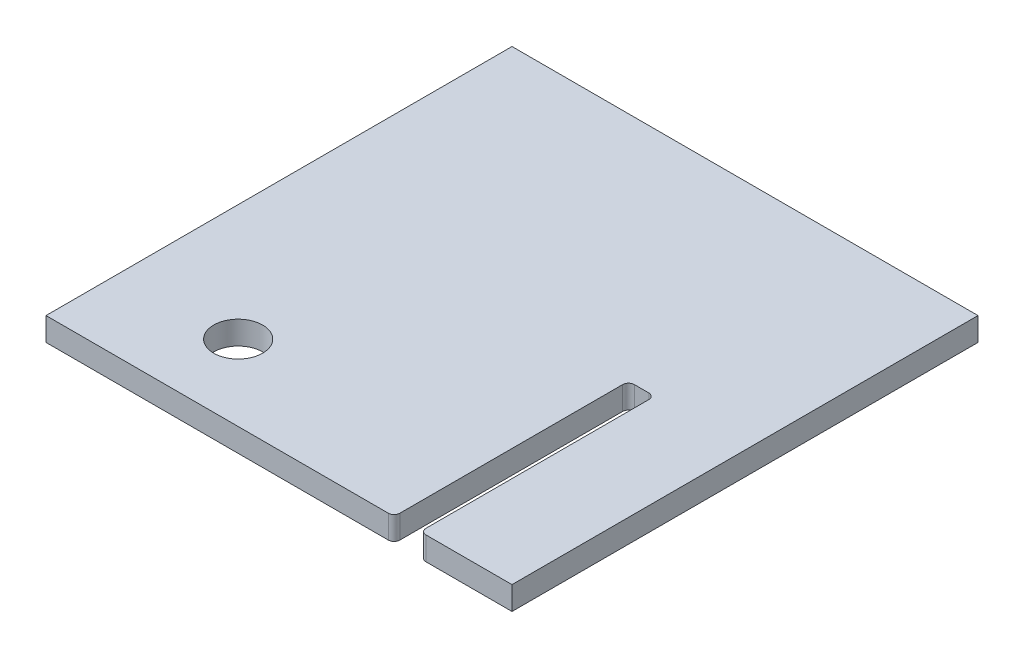
ISO-10303-21;
HEADER;
FILE_DESCRIPTION(('STEP AP214'),'2;1');
FILE_NAME('part.step','',(''),(''),'','','');
FILE_SCHEMA(('AUTOMOTIVE_DESIGN { 1 0 10303 214 1 1 1 1 }'));
ENDSEC;
DATA;
#1=APPLICATION_CONTEXT('core data for automotive mechanical design processes');
#2=APPLICATION_PROTOCOL_DEFINITION('international standard','automotive_design',2000,#1);
#3=PRODUCT_CONTEXT('',#1,'mechanical');
#4=PRODUCT('Part','Part','',(#3));
#5=PRODUCT_RELATED_PRODUCT_CATEGORY('part','',(#4));
#6=PRODUCT_DEFINITION_FORMATION('','',#4);
#7=PRODUCT_DEFINITION_CONTEXT('part definition',#1,'design');
#8=PRODUCT_DEFINITION('design','',#6,#7);
#9=PRODUCT_DEFINITION_SHAPE('','',#8);
#10=(LENGTH_UNIT() NAMED_UNIT(*) SI_UNIT(.MILLI.,.METRE.));
#11=(NAMED_UNIT(*) PLANE_ANGLE_UNIT() SI_UNIT($,.RADIAN.));
#12=(NAMED_UNIT(*) SI_UNIT($,.STERADIAN.) SOLID_ANGLE_UNIT());
#13=UNCERTAINTY_MEASURE_WITH_UNIT(LENGTH_MEASURE(1.E-05),#10,'distance_accuracy_value','');
#14=(GEOMETRIC_REPRESENTATION_CONTEXT(3) GLOBAL_UNCERTAINTY_ASSIGNED_CONTEXT((#13)) GLOBAL_UNIT_ASSIGNED_CONTEXT((#10,
#11,#12)) REPRESENTATION_CONTEXT('',''));
#15=CARTESIAN_POINT('',(0.,0.,0.));
#16=DIRECTION('',(0.,0.,1.));
#17=DIRECTION('',(1.,0.,0.));
#18=AXIS2_PLACEMENT_3D('',#15,#16,#17);
#19=CARTESIAN_POINT('',(-127.,6.35,0.));
#20=DIRECTION('',(0.,0.,-1.));
#21=DIRECTION('',(-1.,0.,0.));
#22=AXIS2_PLACEMENT_3D('',#19,#20,#21);
#23=PLANE('',#22);
#24=DIRECTION('',(1.,0.,0.));
#25=VECTOR('',#24,1.);
#26=CARTESIAN_POINT('',(-127.,6.35,0.));
#27=LINE('',#26,#25);
#28=CARTESIAN_POINT('',(80.1370000000002,6.35,0.));
#29=VERTEX_POINT('',#28);
#30=CARTESIAN_POINT('',(127.,6.35,0.));
#31=VERTEX_POINT('',#30);
#32=EDGE_CURVE('E186',#29,#31,#27,.T.);
#33=ORIENTED_EDGE('',*,*,#32,.F.);
#34=DIRECTION('',(0.,1.,0.));
#35=VECTOR('',#34,1.);
#36=CARTESIAN_POINT('',(80.1370000000002,6.35,0.));
#37=LINE('',#36,#35);
#38=CARTESIAN_POINT('',(80.1370000000002,-6.35,0.));
#39=VERTEX_POINT('',#38);
#40=EDGE_CURVE('E220',#29,#39,#37,.F.);
#41=ORIENTED_EDGE('',*,*,#40,.T.);
#42=DIRECTION('',(1.,0.,0.));
#43=VECTOR('',#42,1.);
#44=CARTESIAN_POINT('',(-127.,-6.35,0.));
#45=LINE('',#44,#43);
#46=CARTESIAN_POINT('',(127.,-6.35,0.));
#47=VERTEX_POINT('',#46);
#48=EDGE_CURVE('E159',#39,#47,#45,.T.);
#49=ORIENTED_EDGE('',*,*,#48,.T.);
#50=DIRECTION('',(0.,-1.,0.));
#51=VECTOR('',#50,1.);
#52=CARTESIAN_POINT('',(127.,6.35,0.));
#53=LINE('',#52,#51);
#54=EDGE_CURVE('E149',#31,#47,#53,.T.);
#55=ORIENTED_EDGE('',*,*,#54,.F.);
#56=EDGE_LOOP('',(#33,#41,#49,#55));
#57=FACE_BOUND('',#56,.T.);
#58=ADVANCED_FACE('F44',(#57),#23,.F.);
#59=CARTESIAN_POINT('',(-127.,6.35,0.));
#60=DIRECTION('',(1.,0.,0.));
#61=DIRECTION('',(0.,0.,-1.));
#62=AXIS2_PLACEMENT_3D('',#59,#60,#61);
#63=PLANE('',#62);
#64=DIRECTION('',(0.,0.,1.));
#65=VECTOR('',#64,1.);
#66=CARTESIAN_POINT('',(-127.,-6.35,0.));
#67=LINE('',#66,#65);
#68=CARTESIAN_POINT('',(-127.,-6.35,-254.));
#69=VERTEX_POINT('',#68);
#70=CARTESIAN_POINT('',(-127.,-6.35,0.));
#71=VERTEX_POINT('',#70);
#72=EDGE_CURVE('E155',#69,#71,#67,.T.);
#73=ORIENTED_EDGE('',*,*,#72,.T.);
#74=DIRECTION('',(0.,-1.,0.));
#75=VECTOR('',#74,1.);
#76=CARTESIAN_POINT('',(-127.,6.35,0.));
#77=LINE('',#76,#75);
#78=CARTESIAN_POINT('',(-127.,6.35,0.));
#79=VERTEX_POINT('',#78);
#80=EDGE_CURVE('E291',#79,#71,#77,.T.);
#81=ORIENTED_EDGE('',*,*,#80,.F.);
#82=DIRECTION('',(0.,0.,1.));
#83=VECTOR('',#82,1.);
#84=CARTESIAN_POINT('',(-127.,6.35,0.));
#85=LINE('',#84,#83);
#86=CARTESIAN_POINT('',(-127.,6.35,-254.));
#87=VERTEX_POINT('',#86);
#88=EDGE_CURVE('E157',#87,#79,#85,.T.);
#89=ORIENTED_EDGE('',*,*,#88,.F.);
#90=DIRECTION('',(0.,-1.,0.));
#91=VECTOR('',#90,1.);
#92=CARTESIAN_POINT('',(-127.,6.35,-254.));
#93=LINE('',#92,#91);
#94=EDGE_CURVE('E142',#87,#69,#93,.T.);
#95=ORIENTED_EDGE('',*,*,#94,.T.);
#96=EDGE_LOOP('',(#73,#81,#89,#95));
#97=FACE_BOUND('',#96,.T.);
#98=ADVANCED_FACE('F153',(#97),#63,.F.);
#99=CARTESIAN_POINT('',(59.5630000000002,-6.35,0.));
#100=VERTEX_POINT('',#99);
#101=EDGE_CURVE('E164',#71,#100,#45,.T.);
#102=ORIENTED_EDGE('',*,*,#101,.T.);
#103=DIRECTION('',(0.,1.,0.));
#104=VECTOR('',#103,1.);
#105=CARTESIAN_POINT('',(59.5630000000002,6.35,0.));
#106=LINE('',#105,#104);
#107=CARTESIAN_POINT('',(59.5630000000002,6.35,0.));
#108=VERTEX_POINT('',#107);
#109=EDGE_CURVE('E228',#100,#108,#106,.T.);
#110=ORIENTED_EDGE('',*,*,#109,.T.);
#111=EDGE_CURVE('E182',#79,#108,#27,.T.);
#112=ORIENTED_EDGE('',*,*,#111,.F.);
#113=ORIENTED_EDGE('',*,*,#80,.T.);
#114=EDGE_LOOP('',(#102,#110,#112,#113));
#115=FACE_BOUND('',#114,.T.);
#116=ADVANCED_FACE('F290',(#115),#23,.F.);
#117=CARTESIAN_POINT('',(127.,6.35,0.));
#118=DIRECTION('',(-1.,0.,0.));
#119=DIRECTION('',(0.,0.,1.));
#120=AXIS2_PLACEMENT_3D('',#117,#118,#119);
#121=PLANE('',#120);
#122=DIRECTION('',(0.,0.,-1.));
#123=VECTOR('',#122,1.);
#124=CARTESIAN_POINT('',(127.,-6.35,0.));
#125=LINE('',#124,#123);
#126=CARTESIAN_POINT('',(127.,-6.35,-254.));
#127=VERTEX_POINT('',#126);
#128=EDGE_CURVE('E295',#47,#127,#125,.T.);
#129=ORIENTED_EDGE('',*,*,#128,.T.);
#130=DIRECTION('',(0.,-1.,0.));
#131=VECTOR('',#130,1.);
#132=CARTESIAN_POINT('',(127.,6.35,-254.));
#133=LINE('',#132,#131);
#134=CARTESIAN_POINT('',(127.,6.35,-254.));
#135=VERTEX_POINT('',#134);
#136=EDGE_CURVE('E145',#135,#127,#133,.T.);
#137=ORIENTED_EDGE('',*,*,#136,.F.);
#138=DIRECTION('',(0.,0.,-1.));
#139=VECTOR('',#138,1.);
#140=CARTESIAN_POINT('',(127.,6.35,0.));
#141=LINE('',#140,#139);
#142=EDGE_CURVE('E179',#31,#135,#141,.T.);
#143=ORIENTED_EDGE('',*,*,#142,.F.);
#144=ORIENTED_EDGE('',*,*,#54,.T.);
#145=EDGE_LOOP('',(#129,#137,#143,#144));
#146=FACE_BOUND('',#145,.T.);
#147=ADVANCED_FACE('F304',(#146),#121,.F.);
#148=CARTESIAN_POINT('',(-127.,6.35,-254.));
#149=DIRECTION('',(0.,0.,1.));
#150=DIRECTION('',(1.,0.,0.));
#151=AXIS2_PLACEMENT_3D('',#148,#149,#150);
#152=PLANE('',#151);
#153=DIRECTION('',(-1.,0.,0.));
#154=VECTOR('',#153,1.);
#155=CARTESIAN_POINT('',(-127.,-6.35,-254.));
#156=LINE('',#155,#154);
#157=EDGE_CURVE('E138',#127,#69,#156,.T.);
#158=ORIENTED_EDGE('',*,*,#157,.T.);
#159=ORIENTED_EDGE('',*,*,#94,.F.);
#160=DIRECTION('',(-1.,0.,0.));
#161=VECTOR('',#160,1.);
#162=CARTESIAN_POINT('',(-127.,6.35,-254.));
#163=LINE('',#162,#161);
#164=EDGE_CURVE('E175',#135,#87,#163,.T.);
#165=ORIENTED_EDGE('',*,*,#164,.F.);
#166=ORIENTED_EDGE('',*,*,#136,.T.);
#167=EDGE_LOOP('',(#158,#159,#165,#166));
#168=FACE_BOUND('',#167,.T.);
#169=ADVANCED_FACE('F140',(#168),#152,.F.);
#170=CARTESIAN_POINT('',(0.,6.35,0.));
#171=DIRECTION('',(0.,-1.,0.));
#172=DIRECTION('',(0.,0.,-1.));
#173=AXIS2_PLACEMENT_3D('',#170,#171,#172);
#174=PLANE('',#173);
#175=CARTESIAN_POINT('',(-63.4999999999998,6.35000000000002,-41.2500000000038));
#176=DIRECTION('',(0.,-1.,0.));
#177=DIRECTION('',(0.,0.,-1.));
#178=AXIS2_PLACEMENT_3D('',#175,#176,#177);
#179=CIRCLE('',#178,13.335);
#180=CARTESIAN_POINT('',(-63.4999999999998,6.35000000000002,-54.5850000000038));
#181=VERTEX_POINT('',#180);
#182=EDGE_CURVE('E48',#181,#181,#179,.F.);
#183=ORIENTED_EDGE('',*,*,#182,.F.);
#184=EDGE_LOOP('',(#183));
#185=FACE_BOUND('',#184,.T.);
#186=DIRECTION('',(0.,0.,-1.));
#187=VECTOR('',#186,1.);
#188=CARTESIAN_POINT('',(76.9620000000002,6.35,0.));
#189=LINE('',#188,#187);
#190=CARTESIAN_POINT('',(76.9620000000002,6.35,-3.17500000000004));
#191=VERTEX_POINT('',#190);
#192=CARTESIAN_POINT('',(76.9620000000002,6.35,-124.587));
#193=VERTEX_POINT('',#192);
#194=EDGE_CURVE('E200',#191,#193,#189,.T.);
#195=ORIENTED_EDGE('',*,*,#194,.F.);
#196=CARTESIAN_POINT('',(80.1370000000002,6.35,-3.17500000000004));
#197=DIRECTION('',(0.,-1.,0.));
#198=DIRECTION('',(0.,0.,-1.));
#199=AXIS2_PLACEMENT_3D('',#196,#197,#198);
#200=CIRCLE('',#199,3.175);
#201=EDGE_CURVE('E217',#191,#29,#200,.F.);
#202=ORIENTED_EDGE('',*,*,#201,.T.);
#203=ORIENTED_EDGE('',*,*,#32,.T.);
#204=ORIENTED_EDGE('',*,*,#142,.T.);
#205=ORIENTED_EDGE('',*,*,#164,.T.);
#206=ORIENTED_EDGE('',*,*,#88,.T.);
#207=ORIENTED_EDGE('',*,*,#111,.T.);
#208=CARTESIAN_POINT('',(59.5630000000002,6.35,-3.17500000000003));
#209=DIRECTION('',(0.,-1.,0.));
#210=DIRECTION('',(0.,0.,-1.));
#211=AXIS2_PLACEMENT_3D('',#208,#209,#210);
#212=CIRCLE('',#211,3.175);
#213=CARTESIAN_POINT('',(62.7380000000002,6.35,-3.17500000000003));
#214=VERTEX_POINT('',#213);
#215=EDGE_CURVE('E214',#108,#214,#212,.F.);
#216=ORIENTED_EDGE('',*,*,#215,.T.);
#217=DIRECTION('',(0.,0.,1.));
#218=VECTOR('',#217,1.);
#219=CARTESIAN_POINT('',(62.7380000000002,6.35,0.));
#220=LINE('',#219,#218);
#221=CARTESIAN_POINT('',(62.7380000000002,6.35,-124.587));
#222=VERTEX_POINT('',#221);
#223=EDGE_CURVE('E193',#222,#214,#220,.T.);
#224=ORIENTED_EDGE('',*,*,#223,.F.);
#225=CARTESIAN_POINT('',(65.9130000000002,6.35,-124.587));
#226=DIRECTION('',(0.,-1.,0.));
#227=DIRECTION('',(0.,0.,-1.));
#228=AXIS2_PLACEMENT_3D('',#225,#226,#227);
#229=CIRCLE('',#228,3.175);
#230=CARTESIAN_POINT('',(65.9130000000002,6.35,-127.762));
#231=VERTEX_POINT('',#230);
#232=EDGE_CURVE('E245',#222,#231,#229,.T.);
#233=ORIENTED_EDGE('',*,*,#232,.T.);
#234=DIRECTION('',(-1.,0.,0.));
#235=VECTOR('',#234,1.);
#236=CARTESIAN_POINT('',(76.2000000000002,6.35,-127.762));
#237=LINE('',#236,#235);
#238=CARTESIAN_POINT('',(73.7870000000002,6.35,-127.762));
#239=VERTEX_POINT('',#238);
#240=EDGE_CURVE('E196',#239,#231,#237,.T.);
#241=ORIENTED_EDGE('',*,*,#240,.F.);
#242=CARTESIAN_POINT('',(73.7870000000002,6.35,-124.587));
#243=DIRECTION('',(0.,-1.,0.));
#244=DIRECTION('',(0.,0.,-1.));
#245=AXIS2_PLACEMENT_3D('',#242,#243,#244);
#246=CIRCLE('',#245,3.175);
#247=EDGE_CURVE('E54',#239,#193,#246,.T.);
#248=ORIENTED_EDGE('',*,*,#247,.T.);
#249=EDGE_LOOP('',(#195,#202,#203,#204,#205,#206,#207,#216,#224,#233,#241,#248));
#250=FACE_BOUND('',#249,.T.);
#251=ADVANCED_FACE('F260',(#185,#250),#174,.F.);
#252=CARTESIAN_POINT('',(0.,-6.35,0.));
#253=DIRECTION('',(0.,-1.,0.));
#254=DIRECTION('',(0.,0.,-1.));
#255=AXIS2_PLACEMENT_3D('',#252,#253,#254);
#256=PLANE('',#255);
#257=ORIENTED_EDGE('',*,*,#48,.F.);
#258=CARTESIAN_POINT('',(80.1370000000002,-6.35,-3.17500000000004));
#259=DIRECTION('',(0.,-1.,0.));
#260=DIRECTION('',(0.,0.,-1.));
#261=AXIS2_PLACEMENT_3D('',#258,#259,#260);
#262=CIRCLE('',#261,3.175);
#263=CARTESIAN_POINT('',(76.9620000000002,-6.35,-3.17500000000004));
#264=VERTEX_POINT('',#263);
#265=EDGE_CURVE('E225',#39,#264,#262,.T.);
#266=ORIENTED_EDGE('',*,*,#265,.T.);
#267=DIRECTION('',(0.,0.,-1.));
#268=VECTOR('',#267,1.);
#269=CARTESIAN_POINT('',(76.9620000000002,-6.35,0.));
#270=LINE('',#269,#268);
#271=CARTESIAN_POINT('',(76.9620000000002,-6.35,-124.587));
#272=VERTEX_POINT('',#271);
#273=EDGE_CURVE('E191',#264,#272,#270,.T.);
#274=ORIENTED_EDGE('',*,*,#273,.T.);
#275=CARTESIAN_POINT('',(73.7870000000002,-6.35,-124.587));
#276=DIRECTION('',(0.,-1.,0.));
#277=DIRECTION('',(0.,0.,-1.));
#278=AXIS2_PLACEMENT_3D('',#275,#276,#277);
#279=CIRCLE('',#278,3.175);
#280=CARTESIAN_POINT('',(73.7870000000002,-6.35,-127.762));
#281=VERTEX_POINT('',#280);
#282=EDGE_CURVE('E12',#272,#281,#279,.F.);
#283=ORIENTED_EDGE('',*,*,#282,.T.);
#284=DIRECTION('',(-1.,0.,0.));
#285=VECTOR('',#284,1.);
#286=CARTESIAN_POINT('',(76.2000000000002,-6.35,-127.762));
#287=LINE('',#286,#285);
#288=CARTESIAN_POINT('',(65.9130000000002,-6.35,-127.762));
#289=VERTEX_POINT('',#288);
#290=EDGE_CURVE('E170',#281,#289,#287,.T.);
#291=ORIENTED_EDGE('',*,*,#290,.T.);
#292=CARTESIAN_POINT('',(65.9130000000002,-6.35,-124.587));
#293=DIRECTION('',(0.,-1.,0.));
#294=DIRECTION('',(0.,0.,-1.));
#295=AXIS2_PLACEMENT_3D('',#292,#293,#294);
#296=CIRCLE('',#295,3.175);
#297=CARTESIAN_POINT('',(62.7380000000002,-6.35,-124.587));
#298=VERTEX_POINT('',#297);
#299=EDGE_CURVE('E248',#289,#298,#296,.F.);
#300=ORIENTED_EDGE('',*,*,#299,.T.);
#301=DIRECTION('',(0.,0.,1.));
#302=VECTOR('',#301,1.);
#303=CARTESIAN_POINT('',(62.7380000000002,-6.35,0.));
#304=LINE('',#303,#302);
#305=CARTESIAN_POINT('',(62.7380000000002,-6.35,-3.17500000000003));
#306=VERTEX_POINT('',#305);
#307=EDGE_CURVE('E167',#298,#306,#304,.T.);
#308=ORIENTED_EDGE('',*,*,#307,.T.);
#309=CARTESIAN_POINT('',(59.5630000000002,-6.35,-3.17500000000003));
#310=DIRECTION('',(0.,-1.,0.));
#311=DIRECTION('',(0.,0.,-1.));
#312=AXIS2_PLACEMENT_3D('',#309,#310,#311);
#313=CIRCLE('',#312,3.175);
#314=EDGE_CURVE('E62',#306,#100,#313,.T.);
#315=ORIENTED_EDGE('',*,*,#314,.T.);
#316=ORIENTED_EDGE('',*,*,#101,.F.);
#317=ORIENTED_EDGE('',*,*,#72,.F.);
#318=ORIENTED_EDGE('',*,*,#157,.F.);
#319=ORIENTED_EDGE('',*,*,#128,.F.);
#320=EDGE_LOOP('',(#257,#266,#274,#283,#291,#300,#308,#315,#316,#317,#318,#319));
#321=FACE_BOUND('',#320,.T.);
#322=CARTESIAN_POINT('',(-63.4999999999998,-6.35000000000002,-41.2500000000038));
#323=DIRECTION('',(0.,-1.,0.));
#324=DIRECTION('',(0.,0.,-1.));
#325=AXIS2_PLACEMENT_3D('',#322,#323,#324);
#326=CIRCLE('',#325,13.335);
#327=CARTESIAN_POINT('',(-63.4999999999998,-6.35000000000002,-54.5850000000038));
#328=VERTEX_POINT('',#327);
#329=EDGE_CURVE('E178',#328,#328,#326,.F.);
#330=ORIENTED_EDGE('',*,*,#329,.T.);
#331=EDGE_LOOP('',(#330));
#332=FACE_BOUND('',#331,.T.);
#333=ADVANCED_FACE('F162',(#321,#332),#256,.T.);
#334=CARTESIAN_POINT('',(-63.4999999999998,280.149999999998,-41.2500000000038));
#335=DIRECTION('',(0.,-1.,0.));
#336=DIRECTION('',(0.,0.,-1.));
#337=AXIS2_PLACEMENT_3D('',#334,#335,#336);
#338=CYLINDRICAL_SURFACE('',#337,13.335);
#339=ORIENTED_EDGE('',*,*,#329,.F.);
#340=EDGE_LOOP('',(#339));
#341=FACE_BOUND('',#340,.T.);
#342=ORIENTED_EDGE('',*,*,#182,.T.);
#343=EDGE_LOOP('',(#342));
#344=FACE_BOUND('',#343,.T.);
#345=ADVANCED_FACE('F46',(#341,#344),#338,.F.);
#346=CARTESIAN_POINT('',(76.9620000000002,-6.35000000000002,0.));
#347=DIRECTION('',(1.,0.,0.));
#348=DIRECTION('',(0.,0.,-1.));
#349=AXIS2_PLACEMENT_3D('',#346,#347,#348);
#350=PLANE('',#349);
#351=ORIENTED_EDGE('',*,*,#273,.F.);
#352=DIRECTION('',(0.,1.,0.));
#353=VECTOR('',#352,1.);
#354=CARTESIAN_POINT('',(76.9620000000002,-6.35000000000002,-3.17500000000004));
#355=LINE('',#354,#353);
#356=EDGE_CURVE('E210',#264,#191,#355,.T.);
#357=ORIENTED_EDGE('',*,*,#356,.T.);
#358=ORIENTED_EDGE('',*,*,#194,.T.);
#359=DIRECTION('',(0.,1.,0.));
#360=VECTOR('',#359,1.);
#361=CARTESIAN_POINT('',(76.9620000000002,-6.35,-124.587));
#362=LINE('',#361,#360);
#363=EDGE_CURVE('E207',#193,#272,#362,.F.);
#364=ORIENTED_EDGE('',*,*,#363,.T.);
#365=EDGE_LOOP('',(#351,#357,#358,#364));
#366=FACE_BOUND('',#365,.T.);
#367=ADVANCED_FACE('F270',(#366),#350,.F.);
#368=CARTESIAN_POINT('',(62.7380000000002,-6.35000000000002,0.));
#369=DIRECTION('',(-1.,0.,0.));
#370=DIRECTION('',(0.,0.,1.));
#371=AXIS2_PLACEMENT_3D('',#368,#369,#370);
#372=PLANE('',#371);
#373=ORIENTED_EDGE('',*,*,#223,.T.);
#374=DIRECTION('',(0.,1.,0.));
#375=VECTOR('',#374,1.);
#376=CARTESIAN_POINT('',(62.7380000000002,-6.35000000000002,-3.17500000000003));
#377=LINE('',#376,#375);
#378=EDGE_CURVE('E70',#214,#306,#377,.F.);
#379=ORIENTED_EDGE('',*,*,#378,.T.);
#380=ORIENTED_EDGE('',*,*,#307,.F.);
#381=DIRECTION('',(0.,1.,0.));
#382=VECTOR('',#381,1.);
#383=CARTESIAN_POINT('',(62.7380000000002,6.35,-124.587));
#384=LINE('',#383,#382);
#385=EDGE_CURVE('E232',#298,#222,#384,.T.);
#386=ORIENTED_EDGE('',*,*,#385,.T.);
#387=EDGE_LOOP('',(#373,#379,#380,#386));
#388=FACE_BOUND('',#387,.T.);
#389=ADVANCED_FACE('F284',(#388),#372,.F.);
#390=CARTESIAN_POINT('',(76.2000000000002,-6.35000000000002,-127.762));
#391=DIRECTION('',(0.,0.,-1.));
#392=DIRECTION('',(-1.,0.,0.));
#393=AXIS2_PLACEMENT_3D('',#390,#391,#392);
#394=PLANE('',#393);
#395=ORIENTED_EDGE('',*,*,#240,.T.);
#396=DIRECTION('',(0.,1.,0.));
#397=VECTOR('',#396,1.);
#398=CARTESIAN_POINT('',(65.9130000000002,-6.35,-127.762));
#399=LINE('',#398,#397);
#400=EDGE_CURVE('E242',#231,#289,#399,.F.);
#401=ORIENTED_EDGE('',*,*,#400,.T.);
#402=ORIENTED_EDGE('',*,*,#290,.F.);
#403=DIRECTION('',(0.,1.,0.));
#404=VECTOR('',#403,1.);
#405=CARTESIAN_POINT('',(73.7870000000002,6.35,-127.762));
#406=LINE('',#405,#404);
#407=EDGE_CURVE('E238',#281,#239,#406,.T.);
#408=ORIENTED_EDGE('',*,*,#407,.T.);
#409=EDGE_LOOP('',(#395,#401,#402,#408));
#410=FACE_BOUND('',#409,.T.);
#411=ADVANCED_FACE('F279',(#410),#394,.F.);
#412=CARTESIAN_POINT('',(80.1370000000002,-6.35000000000002,-3.17500000000004));
#413=DIRECTION('',(0.,1.,0.));
#414=DIRECTION('',(0.,0.,1.));
#415=AXIS2_PLACEMENT_3D('',#412,#413,#414);
#416=CYLINDRICAL_SURFACE('',#415,3.175);
#417=ORIENTED_EDGE('',*,*,#265,.F.);
#418=ORIENTED_EDGE('',*,*,#40,.F.);
#419=ORIENTED_EDGE('',*,*,#201,.F.);
#420=ORIENTED_EDGE('',*,*,#356,.F.);
#421=EDGE_LOOP('',(#417,#418,#419,#420));
#422=FACE_BOUND('',#421,.T.);
#423=ADVANCED_FACE('F312',(#422),#416,.T.);
#424=CARTESIAN_POINT('',(59.5630000000002,6.35,-3.17500000000003));
#425=DIRECTION('',(0.,1.,0.));
#426=DIRECTION('',(0.,0.,1.));
#427=AXIS2_PLACEMENT_3D('',#424,#425,#426);
#428=CYLINDRICAL_SURFACE('',#427,3.175);
#429=ORIENTED_EDGE('',*,*,#314,.F.);
#430=ORIENTED_EDGE('',*,*,#378,.F.);
#431=ORIENTED_EDGE('',*,*,#215,.F.);
#432=ORIENTED_EDGE('',*,*,#109,.F.);
#433=EDGE_LOOP('',(#429,#430,#431,#432));
#434=FACE_BOUND('',#433,.T.);
#435=ADVANCED_FACE('F288',(#434),#428,.T.);
#436=CARTESIAN_POINT('',(65.9130000000002,-6.35000000000002,-124.587));
#437=DIRECTION('',(0.,-1.,0.));
#438=DIRECTION('',(0.,0.,-1.));
#439=AXIS2_PLACEMENT_3D('',#436,#437,#438);
#440=CYLINDRICAL_SURFACE('',#439,3.175);
#441=ORIENTED_EDGE('',*,*,#299,.F.);
#442=ORIENTED_EDGE('',*,*,#400,.F.);
#443=ORIENTED_EDGE('',*,*,#232,.F.);
#444=ORIENTED_EDGE('',*,*,#385,.F.);
#445=EDGE_LOOP('',(#441,#442,#443,#444));
#446=FACE_BOUND('',#445,.T.);
#447=ADVANCED_FACE('F282',(#446),#440,.F.);
#448=CARTESIAN_POINT('',(73.7870000000002,-6.35000000000002,-124.587));
#449=DIRECTION('',(0.,-1.,0.));
#450=DIRECTION('',(0.,0.,-1.));
#451=AXIS2_PLACEMENT_3D('',#448,#449,#450);
#452=CYLINDRICAL_SURFACE('',#451,3.175);
#453=ORIENTED_EDGE('',*,*,#282,.F.);
#454=ORIENTED_EDGE('',*,*,#363,.F.);
#455=ORIENTED_EDGE('',*,*,#247,.F.);
#456=ORIENTED_EDGE('',*,*,#407,.F.);
#457=EDGE_LOOP('',(#453,#454,#455,#456));
#458=FACE_BOUND('',#457,.T.);
#459=ADVANCED_FACE('F274',(#458),#452,.F.);
#460=CLOSED_SHELL('',(#58,#98,#116,#147,#169,#251,#333,#345,#367,#389,#411,#423,#435,#447,#459));
#461=MANIFOLD_SOLID_BREP('B2',#460);
#462=ADVANCED_BREP_SHAPE_REPRESENTATION('',(#18,#461),#14);
#463=SHAPE_DEFINITION_REPRESENTATION(#9,#462);
ENDSEC;
END-ISO-10303-21;
